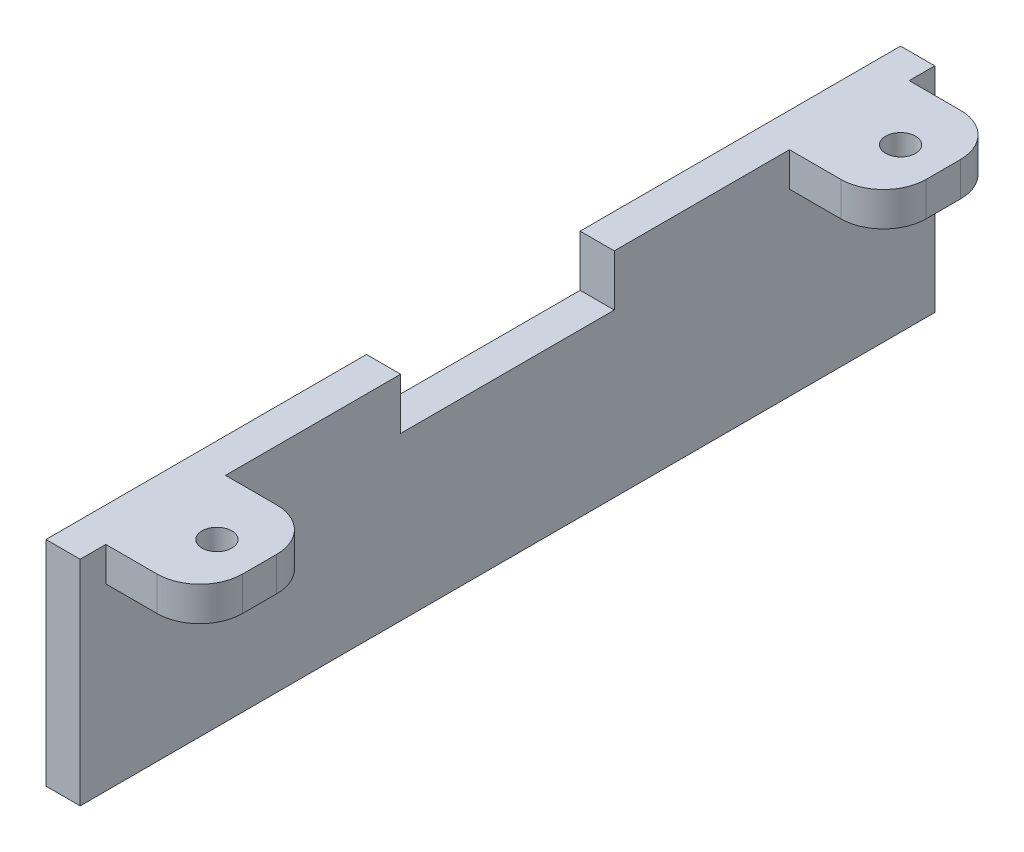
ISO-10303-21;
HEADER;
FILE_DESCRIPTION(('STEP AP214'),'2;1');
FILE_NAME('part.step','',(''),(''),'','','');
FILE_SCHEMA(('AUTOMOTIVE_DESIGN { 1 0 10303 214 1 1 1 1 }'));
ENDSEC;
DATA;
#1=APPLICATION_CONTEXT('core data for automotive mechanical design processes');
#2=APPLICATION_PROTOCOL_DEFINITION('international standard','automotive_design',2000,#1);
#3=PRODUCT_CONTEXT('',#1,'mechanical');
#4=PRODUCT('Part','Part','',(#3));
#5=PRODUCT_RELATED_PRODUCT_CATEGORY('part','',(#4));
#6=PRODUCT_DEFINITION_FORMATION('','',#4);
#7=PRODUCT_DEFINITION_CONTEXT('part definition',#1,'design');
#8=PRODUCT_DEFINITION('design','',#6,#7);
#9=PRODUCT_DEFINITION_SHAPE('','',#8);
#10=(LENGTH_UNIT() NAMED_UNIT(*) SI_UNIT(.MILLI.,.METRE.));
#11=(NAMED_UNIT(*) PLANE_ANGLE_UNIT() SI_UNIT($,.RADIAN.));
#12=(NAMED_UNIT(*) SI_UNIT($,.STERADIAN.) SOLID_ANGLE_UNIT());
#13=UNCERTAINTY_MEASURE_WITH_UNIT(LENGTH_MEASURE(1.E-05),#10,'distance_accuracy_value','');
#14=(GEOMETRIC_REPRESENTATION_CONTEXT(3) GLOBAL_UNCERTAINTY_ASSIGNED_CONTEXT((#13)) GLOBAL_UNIT_ASSIGNED_CONTEXT((#10,
#11,#12)) REPRESENTATION_CONTEXT('',''));
#15=CARTESIAN_POINT('',(0.,0.,0.));
#16=DIRECTION('',(0.,0.,1.));
#17=DIRECTION('',(1.,0.,0.));
#18=AXIS2_PLACEMENT_3D('',#15,#16,#17);
#19=CARTESIAN_POINT('',(15.,0.,100.));
#20=DIRECTION('',(0.,-1.,0.));
#21=DIRECTION('',(1.,0.,0.));
#22=AXIS2_PLACEMENT_3D('',#19,#20,#21);
#23=PLANE('',#22);
#24=CARTESIAN_POINT('',(10.,0.,90.));
#25=DIRECTION('',(0.,1.,0.));
#26=DIRECTION('',(1.,0.,0.));
#27=AXIS2_PLACEMENT_3D('',#24,#25,#26);
#28=CIRCLE('',#27,1.75);
#29=CARTESIAN_POINT('',(11.75,0.,90.));
#30=VERTEX_POINT('',#29);
#31=EDGE_CURVE('E211',#30,#30,#28,.T.);
#32=ORIENTED_EDGE('',*,*,#31,.F.);
#33=EDGE_LOOP('',(#32));
#34=FACE_BOUND('',#33,.T.);
#35=DIRECTION('',(0.,0.,1.));
#36=VECTOR('',#35,1.);
#37=CARTESIAN_POINT('',(4.,0.,17.));
#38=LINE('',#37,#36);
#39=CARTESIAN_POINT('',(4.00000000000001,0.,62.5));
#40=VERTEX_POINT('',#39);
#41=CARTESIAN_POINT('',(4.00000000000001,0.,83.));
#42=VERTEX_POINT('',#41);
#43=EDGE_CURVE('E216',#40,#42,#38,.T.);
#44=ORIENTED_EDGE('',*,*,#43,.F.);
#45=DIRECTION('',(-1.,0.,0.));
#46=VECTOR('',#45,1.);
#47=CARTESIAN_POINT('',(15.,0.,62.5));
#48=LINE('',#47,#46);
#49=CARTESIAN_POINT('',(0.,0.,62.5));
#50=VERTEX_POINT('',#49);
#51=EDGE_CURVE('E195',#40,#50,#48,.T.);
#52=ORIENTED_EDGE('',*,*,#51,.T.);
#53=DIRECTION('',(0.,0.,-1.));
#54=VECTOR('',#53,1.);
#55=CARTESIAN_POINT('',(0.,0.,100.));
#56=LINE('',#55,#54);
#57=CARTESIAN_POINT('',(0.,0.,100.));
#58=VERTEX_POINT('',#57);
#59=EDGE_CURVE('E269',#58,#50,#56,.T.);
#60=ORIENTED_EDGE('',*,*,#59,.F.);
#61=DIRECTION('',(-1.,0.,0.));
#62=VECTOR('',#61,1.);
#63=CARTESIAN_POINT('',(15.,0.,100.));
#64=LINE('',#63,#62);
#65=CARTESIAN_POINT('',(4.,0.,100.));
#66=VERTEX_POINT('',#65);
#67=EDGE_CURVE('E238',#66,#58,#64,.T.);
#68=ORIENTED_EDGE('',*,*,#67,.F.);
#69=DIRECTION('',(0.,0.,1.));
#70=VECTOR('',#69,1.);
#71=CARTESIAN_POINT('',(4.,0.,100.));
#72=LINE('',#71,#70);
#73=CARTESIAN_POINT('',(4.00000000000002,0.,97.));
#74=VERTEX_POINT('',#73);
#75=EDGE_CURVE('E228',#74,#66,#72,.T.);
#76=ORIENTED_EDGE('',*,*,#75,.F.);
#77=DIRECTION('',(-1.,0.,0.));
#78=VECTOR('',#77,1.);
#79=CARTESIAN_POINT('',(4.00000000000002,0.,97.));
#80=LINE('',#79,#78);
#81=CARTESIAN_POINT('',(9.99999999999999,0.,97.));
#82=VERTEX_POINT('',#81);
#83=EDGE_CURVE('E231',#82,#74,#80,.T.);
#84=ORIENTED_EDGE('',*,*,#83,.F.);
#85=CARTESIAN_POINT('',(10.,0.,92.));
#86=DIRECTION('',(0.,-1.,0.));
#87=DIRECTION('',(1.,0.,0.));
#88=AXIS2_PLACEMENT_3D('',#85,#86,#87);
#89=CIRCLE('',#88,5.);
#90=CARTESIAN_POINT('',(15.,0.,92.));
#91=VERTEX_POINT('',#90);
#92=EDGE_CURVE('E298',#82,#91,#89,.F.);
#93=ORIENTED_EDGE('',*,*,#92,.T.);
#94=DIRECTION('',(0.,0.,-1.));
#95=VECTOR('',#94,1.);
#96=CARTESIAN_POINT('',(15.,0.,100.));
#97=LINE('',#96,#95);
#98=CARTESIAN_POINT('',(15.,0.,88.));
#99=VERTEX_POINT('',#98);
#100=EDGE_CURVE('E272',#91,#99,#97,.T.);
#101=ORIENTED_EDGE('',*,*,#100,.T.);
#102=CARTESIAN_POINT('',(10.,0.,88.));
#103=DIRECTION('',(0.,-1.,0.));
#104=DIRECTION('',(1.,0.,0.));
#105=AXIS2_PLACEMENT_3D('',#102,#103,#104);
#106=CIRCLE('',#105,5.);
#107=CARTESIAN_POINT('',(10.,0.,83.));
#108=VERTEX_POINT('',#107);
#109=EDGE_CURVE('E294',#99,#108,#106,.F.);
#110=ORIENTED_EDGE('',*,*,#109,.T.);
#111=DIRECTION('',(1.,0.,0.));
#112=VECTOR('',#111,1.);
#113=CARTESIAN_POINT('',(15.,0.,83.));
#114=LINE('',#113,#112);
#115=EDGE_CURVE('E220',#42,#108,#114,.T.);
#116=ORIENTED_EDGE('',*,*,#115,.F.);
#117=EDGE_LOOP('',(#44,#52,#60,#68,#76,#84,#93,#101,#110,#116));
#118=FACE_BOUND('',#117,.T.);
#119=ADVANCED_FACE('F33',(#34,#118),#23,.F.);
#120=CARTESIAN_POINT('',(15.,-4.,100.));
#121=DIRECTION('',(-1.,0.,0.));
#122=DIRECTION('',(0.,0.,1.));
#123=AXIS2_PLACEMENT_3D('',#120,#121,#122);
#124=PLANE('',#123);
#125=ORIENTED_EDGE('',*,*,#100,.F.);
#126=DIRECTION('',(0.,1.,0.));
#127=VECTOR('',#126,1.);
#128=CARTESIAN_POINT('',(15.,-4.,92.));
#129=LINE('',#128,#127);
#130=CARTESIAN_POINT('',(15.,-4.,92.));
#131=VERTEX_POINT('',#130);
#132=EDGE_CURVE('E303',#91,#131,#129,.F.);
#133=ORIENTED_EDGE('',*,*,#132,.T.);
#134=DIRECTION('',(0.,0.,-1.));
#135=VECTOR('',#134,1.);
#136=CARTESIAN_POINT('',(15.,-4.,100.));
#137=LINE('',#136,#135);
#138=CARTESIAN_POINT('',(15.,-4.,88.));
#139=VERTEX_POINT('',#138);
#140=EDGE_CURVE('E258',#131,#139,#137,.T.);
#141=ORIENTED_EDGE('',*,*,#140,.T.);
#142=DIRECTION('',(0.,1.,0.));
#143=VECTOR('',#142,1.);
#144=CARTESIAN_POINT('',(15.,-4.,88.));
#145=LINE('',#144,#143);
#146=EDGE_CURVE('E300',#139,#99,#145,.T.);
#147=ORIENTED_EDGE('',*,*,#146,.T.);
#148=EDGE_LOOP('',(#125,#133,#141,#147));
#149=FACE_BOUND('',#148,.T.);
#150=ADVANCED_FACE('F373',(#149),#124,.F.);
#151=CARTESIAN_POINT('',(4.00000000000001,-4.,100.));
#152=DIRECTION('',(0.,1.,0.));
#153=DIRECTION('',(-1.,0.,0.));
#154=AXIS2_PLACEMENT_3D('',#151,#152,#153);
#155=PLANE('',#154);
#156=CARTESIAN_POINT('',(10.,-4.,90.));
#157=DIRECTION('',(0.,1.,0.));
#158=DIRECTION('',(-1.,0.,0.));
#159=AXIS2_PLACEMENT_3D('',#156,#157,#158);
#160=CIRCLE('',#159,1.75);
#161=CARTESIAN_POINT('',(8.25000000000001,-4.,90.));
#162=VERTEX_POINT('',#161);
#163=EDGE_CURVE('E208',#162,#162,#160,.T.);
#164=ORIENTED_EDGE('',*,*,#163,.T.);
#165=EDGE_LOOP('',(#164));
#166=FACE_BOUND('',#165,.T.);
#167=ORIENTED_EDGE('',*,*,#140,.F.);
#168=CARTESIAN_POINT('',(10.,-4.,92.));
#169=DIRECTION('',(0.,1.,0.));
#170=DIRECTION('',(-1.,0.,0.));
#171=AXIS2_PLACEMENT_3D('',#168,#169,#170);
#172=CIRCLE('',#171,5.);
#173=CARTESIAN_POINT('',(9.99999999999999,-4.,97.));
#174=VERTEX_POINT('',#173);
#175=EDGE_CURVE('E307',#131,#174,#172,.F.);
#176=ORIENTED_EDGE('',*,*,#175,.T.);
#177=DIRECTION('',(-1.,0.,0.));
#178=VECTOR('',#177,1.);
#179=CARTESIAN_POINT('',(4.00000000000001,-4.,97.));
#180=LINE('',#179,#178);
#181=CARTESIAN_POINT('',(4.00000000000002,-4.,97.));
#182=VERTEX_POINT('',#181);
#183=EDGE_CURVE('E275',#174,#182,#180,.T.);
#184=ORIENTED_EDGE('',*,*,#183,.T.);
#185=DIRECTION('',(0.,0.,-1.));
#186=VECTOR('',#185,1.);
#187=CARTESIAN_POINT('',(4.00000000000001,-4.,100.));
#188=LINE('',#187,#186);
#189=CARTESIAN_POINT('',(4.00000000000001,-4.,83.));
#190=VERTEX_POINT('',#189);
#191=EDGE_CURVE('E259',#182,#190,#188,.T.);
#192=ORIENTED_EDGE('',*,*,#191,.T.);
#193=DIRECTION('',(1.,0.,0.));
#194=VECTOR('',#193,1.);
#195=CARTESIAN_POINT('',(4.00000000000001,-4.,83.));
#196=LINE('',#195,#194);
#197=CARTESIAN_POINT('',(10.,-4.,83.));
#198=VERTEX_POINT('',#197);
#199=EDGE_CURVE('E279',#190,#198,#196,.T.);
#200=ORIENTED_EDGE('',*,*,#199,.T.);
#201=CARTESIAN_POINT('',(10.,-4.,88.));
#202=DIRECTION('',(0.,1.,0.));
#203=DIRECTION('',(-1.,0.,0.));
#204=AXIS2_PLACEMENT_3D('',#201,#202,#203);
#205=CIRCLE('',#204,5.);
#206=EDGE_CURVE('E305',#198,#139,#205,.F.);
#207=ORIENTED_EDGE('',*,*,#206,.T.);
#208=EDGE_LOOP('',(#167,#176,#184,#192,#200,#207));
#209=FACE_BOUND('',#208,.T.);
#210=ADVANCED_FACE('F387',(#166,#209),#155,.F.);
#211=CARTESIAN_POINT('',(15.,-4.,12.));
#212=VERTEX_POINT('',#211);
#213=CARTESIAN_POINT('',(15.,-4.,8.00000000000002));
#214=VERTEX_POINT('',#213);
#215=EDGE_CURVE('E247',#212,#214,#137,.T.);
#216=ORIENTED_EDGE('',*,*,#215,.T.);
#217=DIRECTION('',(0.,1.,0.));
#218=VECTOR('',#217,1.);
#219=CARTESIAN_POINT('',(15.,-4.,8.00000000000002));
#220=LINE('',#219,#218);
#221=CARTESIAN_POINT('',(15.,0.,8.00000000000002));
#222=VERTEX_POINT('',#221);
#223=EDGE_CURVE('E311',#214,#222,#220,.T.);
#224=ORIENTED_EDGE('',*,*,#223,.T.);
#225=CARTESIAN_POINT('',(15.,0.,12.));
#226=VERTEX_POINT('',#225);
#227=EDGE_CURVE('E271',#226,#222,#97,.T.);
#228=ORIENTED_EDGE('',*,*,#227,.F.);
#229=DIRECTION('',(0.,1.,0.));
#230=VECTOR('',#229,1.);
#231=CARTESIAN_POINT('',(15.,-4.,12.));
#232=LINE('',#231,#230);
#233=EDGE_CURVE('E309',#226,#212,#232,.F.);
#234=ORIENTED_EDGE('',*,*,#233,.T.);
#235=EDGE_LOOP('',(#216,#224,#228,#234));
#236=FACE_BOUND('',#235,.T.);
#237=ADVANCED_FACE('F359',(#236),#124,.F.);
#238=CARTESIAN_POINT('',(10.,0.,10.));
#239=DIRECTION('',(0.,1.,0.));
#240=DIRECTION('',(-1.,0.,0.));
#241=AXIS2_PLACEMENT_3D('',#238,#239,#240);
#242=CIRCLE('',#241,1.75);
#243=CARTESIAN_POINT('',(8.25,0.,10.));
#244=VERTEX_POINT('',#243);
#245=EDGE_CURVE('E203',#244,#244,#242,.T.);
#246=ORIENTED_EDGE('',*,*,#245,.F.);
#247=EDGE_LOOP('',(#246));
#248=FACE_BOUND('',#247,.T.);
#249=CARTESIAN_POINT('',(0.,0.,37.5));
#250=VERTEX_POINT('',#249);
#251=CARTESIAN_POINT('',(0.,0.,0.));
#252=VERTEX_POINT('',#251);
#253=EDGE_CURVE('E268',#250,#252,#56,.T.);
#254=ORIENTED_EDGE('',*,*,#253,.F.);
#255=DIRECTION('',(1.,0.,0.));
#256=VECTOR('',#255,1.);
#257=CARTESIAN_POINT('',(15.,0.,37.5));
#258=LINE('',#257,#256);
#259=CARTESIAN_POINT('',(4.00000000000001,0.,37.5));
#260=VERTEX_POINT('',#259);
#261=EDGE_CURVE('E183',#250,#260,#258,.T.);
#262=ORIENTED_EDGE('',*,*,#261,.T.);
#263=CARTESIAN_POINT('',(4.,0.,17.));
#264=VERTEX_POINT('',#263);
#265=EDGE_CURVE('E217',#264,#260,#38,.T.);
#266=ORIENTED_EDGE('',*,*,#265,.F.);
#267=DIRECTION('',(-1.,0.,0.));
#268=VECTOR('',#267,1.);
#269=CARTESIAN_POINT('',(15.,0.,17.));
#270=LINE('',#269,#268);
#271=CARTESIAN_POINT('',(10.,0.,17.));
#272=VERTEX_POINT('',#271);
#273=EDGE_CURVE('E198',#272,#264,#270,.T.);
#274=ORIENTED_EDGE('',*,*,#273,.F.);
#275=CARTESIAN_POINT('',(10.,0.,12.));
#276=DIRECTION('',(0.,-1.,0.));
#277=DIRECTION('',(1.,0.,0.));
#278=AXIS2_PLACEMENT_3D('',#275,#276,#277);
#279=CIRCLE('',#278,5.);
#280=EDGE_CURVE('E292',#272,#226,#279,.F.);
#281=ORIENTED_EDGE('',*,*,#280,.T.);
#282=ORIENTED_EDGE('',*,*,#227,.T.);
#283=CARTESIAN_POINT('',(10.,0.,8.00000000000002));
#284=DIRECTION('',(0.,-1.,0.));
#285=DIRECTION('',(1.,0.,0.));
#286=AXIS2_PLACEMENT_3D('',#283,#284,#285);
#287=CIRCLE('',#286,5.);
#288=CARTESIAN_POINT('',(9.99999999999999,0.,3.00000000000002));
#289=VERTEX_POINT('',#288);
#290=EDGE_CURVE('E296',#222,#289,#287,.F.);
#291=ORIENTED_EDGE('',*,*,#290,.T.);
#292=DIRECTION('',(1.,0.,0.));
#293=VECTOR('',#292,1.);
#294=CARTESIAN_POINT('',(4.00000000000001,0.,3.00000000000003));
#295=LINE('',#294,#293);
#296=CARTESIAN_POINT('',(4.00000000000001,0.,3.00000000000003));
#297=VERTEX_POINT('',#296);
#298=EDGE_CURVE('E202',#297,#289,#295,.T.);
#299=ORIENTED_EDGE('',*,*,#298,.F.);
#300=DIRECTION('',(0.,0.,1.));
#301=VECTOR('',#300,1.);
#302=CARTESIAN_POINT('',(4.,0.,0.));
#303=LINE('',#302,#301);
#304=CARTESIAN_POINT('',(4.,0.,0.));
#305=VERTEX_POINT('',#304);
#306=EDGE_CURVE('E199',#305,#297,#303,.T.);
#307=ORIENTED_EDGE('',*,*,#306,.F.);
#308=DIRECTION('',(-1.,0.,0.));
#309=VECTOR('',#308,1.);
#310=CARTESIAN_POINT('',(15.,0.,0.));
#311=LINE('',#310,#309);
#312=EDGE_CURVE('E237',#305,#252,#311,.T.);
#313=ORIENTED_EDGE('',*,*,#312,.T.);
#314=EDGE_LOOP('',(#254,#262,#266,#274,#281,#282,#291,#299,#307,#313));
#315=FACE_BOUND('',#314,.T.);
#316=ADVANCED_FACE('F330',(#248,#315),#23,.F.);
#317=CARTESIAN_POINT('',(0.,0.,100.));
#318=DIRECTION('',(1.,0.,0.));
#319=DIRECTION('',(0.,1.,0.));
#320=AXIS2_PLACEMENT_3D('',#317,#318,#319);
#321=PLANE('',#320);
#322=ORIENTED_EDGE('',*,*,#59,.T.);
#323=DIRECTION('',(0.,1.,0.));
#324=VECTOR('',#323,1.);
#325=CARTESIAN_POINT('',(0.,5.99999999999998,62.5));
#326=LINE('',#325,#324);
#327=CARTESIAN_POINT('',(0.,-6.00000000000001,62.5));
#328=VERTEX_POINT('',#327);
#329=EDGE_CURVE('E186',#328,#50,#326,.T.);
#330=ORIENTED_EDGE('',*,*,#329,.F.);
#331=DIRECTION('',(0.,0.,1.));
#332=VECTOR('',#331,1.);
#333=CARTESIAN_POINT('',(0.,-6.00000000000001,37.5));
#334=LINE('',#333,#332);
#335=CARTESIAN_POINT('',(0.,-6.00000000000001,37.5));
#336=VERTEX_POINT('',#335);
#337=EDGE_CURVE('E173',#336,#328,#334,.T.);
#338=ORIENTED_EDGE('',*,*,#337,.F.);
#339=DIRECTION('',(0.,-1.,0.));
#340=VECTOR('',#339,1.);
#341=CARTESIAN_POINT('',(0.,5.99999999999998,37.5));
#342=LINE('',#341,#340);
#343=EDGE_CURVE('E180',#250,#336,#342,.T.);
#344=ORIENTED_EDGE('',*,*,#343,.F.);
#345=ORIENTED_EDGE('',*,*,#253,.T.);
#346=DIRECTION('',(0.,-1.,0.));
#347=VECTOR('',#346,1.);
#348=CARTESIAN_POINT('',(0.,0.,0.));
#349=LINE('',#348,#347);
#350=CARTESIAN_POINT('',(0.,-25.,0.));
#351=VERTEX_POINT('',#350);
#352=EDGE_CURVE('E250',#252,#351,#349,.T.);
#353=ORIENTED_EDGE('',*,*,#352,.T.);
#354=DIRECTION('',(0.,0.,-1.));
#355=VECTOR('',#354,1.);
#356=CARTESIAN_POINT('',(0.,-25.,100.));
#357=LINE('',#356,#355);
#358=CARTESIAN_POINT('',(0.,-25.,100.));
#359=VERTEX_POINT('',#358);
#360=EDGE_CURVE('E265',#359,#351,#357,.T.);
#361=ORIENTED_EDGE('',*,*,#360,.F.);
#362=DIRECTION('',(0.,-1.,0.));
#363=VECTOR('',#362,1.);
#364=CARTESIAN_POINT('',(0.,0.,100.));
#365=LINE('',#364,#363);
#366=EDGE_CURVE('E240',#58,#359,#365,.T.);
#367=ORIENTED_EDGE('',*,*,#366,.F.);
#368=EDGE_LOOP('',(#322,#330,#338,#344,#345,#353,#361,#367));
#369=FACE_BOUND('',#368,.T.);
#370=ADVANCED_FACE('F189',(#369),#321,.F.);
#371=CARTESIAN_POINT('',(0.,-25.,100.));
#372=DIRECTION('',(0.,1.,0.));
#373=DIRECTION('',(0.,0.,1.));
#374=AXIS2_PLACEMENT_3D('',#371,#372,#373);
#375=PLANE('',#374);
#376=DIRECTION('',(1.,0.,0.));
#377=VECTOR('',#376,1.);
#378=CARTESIAN_POINT('',(0.,-25.,0.));
#379=LINE('',#378,#377);
#380=CARTESIAN_POINT('',(4.,-25.,0.));
#381=VERTEX_POINT('',#380);
#382=EDGE_CURVE('E252',#351,#381,#379,.T.);
#383=ORIENTED_EDGE('',*,*,#382,.T.);
#384=DIRECTION('',(0.,0.,-1.));
#385=VECTOR('',#384,1.);
#386=CARTESIAN_POINT('',(4.,-25.,100.));
#387=LINE('',#386,#385);
#388=CARTESIAN_POINT('',(4.,-25.,100.));
#389=VERTEX_POINT('',#388);
#390=EDGE_CURVE('E262',#389,#381,#387,.T.);
#391=ORIENTED_EDGE('',*,*,#390,.F.);
#392=DIRECTION('',(1.,0.,0.));
#393=VECTOR('',#392,1.);
#394=CARTESIAN_POINT('',(0.,-25.,100.));
#395=LINE('',#394,#393);
#396=EDGE_CURVE('E243',#359,#389,#395,.T.);
#397=ORIENTED_EDGE('',*,*,#396,.F.);
#398=ORIENTED_EDGE('',*,*,#360,.T.);
#399=EDGE_LOOP('',(#383,#391,#397,#398));
#400=FACE_BOUND('',#399,.T.);
#401=ADVANCED_FACE('F341',(#400),#375,.F.);
#402=CARTESIAN_POINT('',(4.,-25.,100.));
#403=DIRECTION('',(-1.,0.,0.));
#404=DIRECTION('',(0.,-1.,0.));
#405=AXIS2_PLACEMENT_3D('',#402,#403,#404);
#406=PLANE('',#405);
#407=DIRECTION('',(0.,0.,1.));
#408=VECTOR('',#407,1.);
#409=CARTESIAN_POINT('',(4.00000000000001,-6.00000000000001,100.));
#410=LINE('',#409,#408);
#411=CARTESIAN_POINT('',(4.00000000000001,-6.00000000000001,37.5));
#412=VERTEX_POINT('',#411);
#413=CARTESIAN_POINT('',(4.,-6.00000000000001,62.5));
#414=VERTEX_POINT('',#413);
#415=EDGE_CURVE('E41',#412,#414,#410,.T.);
#416=ORIENTED_EDGE('',*,*,#415,.T.);
#417=DIRECTION('',(0.,1.,0.));
#418=VECTOR('',#417,1.);
#419=CARTESIAN_POINT('',(4.,-25.,62.5));
#420=LINE('',#419,#418);
#421=EDGE_CURVE('E11',#414,#40,#420,.T.);
#422=ORIENTED_EDGE('',*,*,#421,.T.);
#423=ORIENTED_EDGE('',*,*,#43,.T.);
#424=DIRECTION('',(0.,1.,0.));
#425=VECTOR('',#424,1.);
#426=CARTESIAN_POINT('',(4.00000000000001,-100.,83.));
#427=LINE('',#426,#425);
#428=EDGE_CURVE('E214',#190,#42,#427,.T.);
#429=ORIENTED_EDGE('',*,*,#428,.F.);
#430=ORIENTED_EDGE('',*,*,#191,.F.);
#431=DIRECTION('',(0.,1.,0.));
#432=VECTOR('',#431,1.);
#433=CARTESIAN_POINT('',(4.00000000000002,-100.,97.));
#434=LINE('',#433,#432);
#435=EDGE_CURVE('E234',#182,#74,#434,.T.);
#436=ORIENTED_EDGE('',*,*,#435,.T.);
#437=ORIENTED_EDGE('',*,*,#75,.T.);
#438=DIRECTION('',(0.,1.,0.));
#439=VECTOR('',#438,1.);
#440=CARTESIAN_POINT('',(4.,-25.,100.));
#441=LINE('',#440,#439);
#442=EDGE_CURVE('E245',#389,#66,#441,.T.);
#443=ORIENTED_EDGE('',*,*,#442,.F.);
#444=ORIENTED_EDGE('',*,*,#390,.T.);
#445=DIRECTION('',(0.,1.,0.));
#446=VECTOR('',#445,1.);
#447=CARTESIAN_POINT('',(4.,-25.,0.));
#448=LINE('',#447,#446);
#449=EDGE_CURVE('E241',#381,#305,#448,.T.);
#450=ORIENTED_EDGE('',*,*,#449,.T.);
#451=ORIENTED_EDGE('',*,*,#306,.T.);
#452=DIRECTION('',(0.,1.,0.));
#453=VECTOR('',#452,1.);
#454=CARTESIAN_POINT('',(4.00000000000001,-100.,3.00000000000003));
#455=LINE('',#454,#453);
#456=CARTESIAN_POINT('',(4.00000000000001,-4.,3.00000000000003));
#457=VERTEX_POINT('',#456);
#458=EDGE_CURVE('E206',#457,#297,#455,.T.);
#459=ORIENTED_EDGE('',*,*,#458,.F.);
#460=CARTESIAN_POINT('',(4.00000000000001,-4.,17.));
#461=VERTEX_POINT('',#460);
#462=EDGE_CURVE('E263',#461,#457,#188,.T.);
#463=ORIENTED_EDGE('',*,*,#462,.F.);
#464=DIRECTION('',(0.,1.,0.));
#465=VECTOR('',#464,1.);
#466=CARTESIAN_POINT('',(4.,-100.,17.));
#467=LINE('',#466,#465);
#468=EDGE_CURVE('E223',#461,#264,#467,.T.);
#469=ORIENTED_EDGE('',*,*,#468,.T.);
#470=ORIENTED_EDGE('',*,*,#265,.T.);
#471=DIRECTION('',(0.,-1.,0.));
#472=VECTOR('',#471,1.);
#473=CARTESIAN_POINT('',(4.,-25.,37.5));
#474=LINE('',#473,#472);
#475=EDGE_CURVE('E324',#260,#412,#474,.T.);
#476=ORIENTED_EDGE('',*,*,#475,.T.);
#477=EDGE_LOOP('',(#416,#422,#423,#429,#430,#436,#437,#443,#444,#450,#451,#459,#463,#469,#470,#476));
#478=FACE_BOUND('',#477,.T.);
#479=ADVANCED_FACE('F326',(#478),#406,.F.);
#480=CARTESIAN_POINT('',(10.,-4.,10.));
#481=DIRECTION('',(0.,1.,0.));
#482=DIRECTION('',(-1.,0.,0.));
#483=AXIS2_PLACEMENT_3D('',#480,#481,#482);
#484=CIRCLE('',#483,1.75);
#485=CARTESIAN_POINT('',(8.25,-4.,10.));
#486=VERTEX_POINT('',#485);
#487=EDGE_CURVE('E232',#486,#486,#484,.T.);
#488=ORIENTED_EDGE('',*,*,#487,.T.);
#489=EDGE_LOOP('',(#488));
#490=FACE_BOUND('',#489,.T.);
#491=DIRECTION('',(1.,0.,0.));
#492=VECTOR('',#491,1.);
#493=CARTESIAN_POINT('',(3.99999999999988,-4.,3.00000000000003));
#494=LINE('',#493,#492);
#495=CARTESIAN_POINT('',(9.99999999999999,-4.,3.00000000000002));
#496=VERTEX_POINT('',#495);
#497=EDGE_CURVE('E282',#457,#496,#494,.T.);
#498=ORIENTED_EDGE('',*,*,#497,.T.);
#499=CARTESIAN_POINT('',(10.,-4.,8.00000000000002));
#500=DIRECTION('',(0.,1.,0.));
#501=DIRECTION('',(-1.,0.,0.));
#502=AXIS2_PLACEMENT_3D('',#499,#500,#501);
#503=CIRCLE('',#502,5.);
#504=EDGE_CURVE('E317',#496,#214,#503,.F.);
#505=ORIENTED_EDGE('',*,*,#504,.T.);
#506=ORIENTED_EDGE('',*,*,#215,.F.);
#507=CARTESIAN_POINT('',(10.,-4.,12.));
#508=DIRECTION('',(0.,1.,0.));
#509=DIRECTION('',(-1.,0.,0.));
#510=AXIS2_PLACEMENT_3D('',#507,#508,#509);
#511=CIRCLE('',#510,5.);
#512=CARTESIAN_POINT('',(10.,-4.,17.));
#513=VERTEX_POINT('',#512);
#514=EDGE_CURVE('E56',#212,#513,#511,.F.);
#515=ORIENTED_EDGE('',*,*,#514,.T.);
#516=DIRECTION('',(-1.,0.,0.));
#517=VECTOR('',#516,1.);
#518=CARTESIAN_POINT('',(4.00000000000001,-4.,17.));
#519=LINE('',#518,#517);
#520=EDGE_CURVE('E277',#513,#461,#519,.T.);
#521=ORIENTED_EDGE('',*,*,#520,.T.);
#522=ORIENTED_EDGE('',*,*,#462,.T.);
#523=EDGE_LOOP('',(#498,#505,#506,#515,#521,#522));
#524=FACE_BOUND('',#523,.T.);
#525=ADVANCED_FACE('F356',(#490,#524),#155,.F.);
#526=CARTESIAN_POINT('',(0.,0.,100.));
#527=DIRECTION('',(0.,0.,1.));
#528=DIRECTION('',(1.,0.,0.));
#529=AXIS2_PLACEMENT_3D('',#526,#527,#528);
#530=PLANE('',#529);
#531=ORIENTED_EDGE('',*,*,#442,.T.);
#532=ORIENTED_EDGE('',*,*,#67,.T.);
#533=ORIENTED_EDGE('',*,*,#366,.T.);
#534=ORIENTED_EDGE('',*,*,#396,.T.);
#535=EDGE_LOOP('',(#531,#532,#533,#534));
#536=FACE_BOUND('',#535,.T.);
#537=ADVANCED_FACE('F398',(#536),#530,.T.);
#538=CARTESIAN_POINT('',(0.,0.,0.));
#539=DIRECTION('',(0.,0.,1.));
#540=DIRECTION('',(1.,0.,0.));
#541=AXIS2_PLACEMENT_3D('',#538,#539,#540);
#542=PLANE('',#541);
#543=ORIENTED_EDGE('',*,*,#312,.F.);
#544=ORIENTED_EDGE('',*,*,#449,.F.);
#545=ORIENTED_EDGE('',*,*,#382,.F.);
#546=ORIENTED_EDGE('',*,*,#352,.F.);
#547=EDGE_LOOP('',(#543,#544,#545,#546));
#548=FACE_BOUND('',#547,.T.);
#549=ADVANCED_FACE('F344',(#548),#542,.F.);
#550=CARTESIAN_POINT('',(4.00000000000002,-100.,97.));
#551=DIRECTION('',(0.,0.,-1.));
#552=DIRECTION('',(-1.,0.,0.));
#553=AXIS2_PLACEMENT_3D('',#550,#551,#552);
#554=PLANE('',#553);
#555=ORIENTED_EDGE('',*,*,#183,.F.);
#556=DIRECTION('',(0.,1.,0.));
#557=VECTOR('',#556,1.);
#558=CARTESIAN_POINT('',(9.99999999999999,-100.,97.));
#559=LINE('',#558,#557);
#560=EDGE_CURVE('E289',#174,#82,#559,.T.);
#561=ORIENTED_EDGE('',*,*,#560,.T.);
#562=ORIENTED_EDGE('',*,*,#83,.T.);
#563=ORIENTED_EDGE('',*,*,#435,.F.);
#564=EDGE_LOOP('',(#555,#561,#562,#563));
#565=FACE_BOUND('',#564,.T.);
#566=ADVANCED_FACE('F392',(#565),#554,.F.);
#567=CARTESIAN_POINT('',(4.00000000000001,-100.,3.00000000000003));
#568=DIRECTION('',(0.,0.,1.));
#569=DIRECTION('',(1.,0.,0.));
#570=AXIS2_PLACEMENT_3D('',#567,#568,#569);
#571=PLANE('',#570);
#572=ORIENTED_EDGE('',*,*,#298,.T.);
#573=DIRECTION('',(0.,1.,0.));
#574=VECTOR('',#573,1.);
#575=CARTESIAN_POINT('',(9.99999999999999,-100.,3.00000000000002));
#576=LINE('',#575,#574);
#577=EDGE_CURVE('E314',#289,#496,#576,.F.);
#578=ORIENTED_EDGE('',*,*,#577,.T.);
#579=ORIENTED_EDGE('',*,*,#497,.F.);
#580=ORIENTED_EDGE('',*,*,#458,.T.);
#581=EDGE_LOOP('',(#572,#578,#579,#580));
#582=FACE_BOUND('',#581,.T.);
#583=ADVANCED_FACE('F351',(#582),#571,.F.);
#584=CARTESIAN_POINT('',(15.,-100.,83.));
#585=DIRECTION('',(0.,0.,1.));
#586=DIRECTION('',(1.,0.,0.));
#587=AXIS2_PLACEMENT_3D('',#584,#585,#586);
#588=PLANE('',#587);
#589=ORIENTED_EDGE('',*,*,#115,.T.);
#590=DIRECTION('',(0.,1.,0.));
#591=VECTOR('',#590,1.);
#592=CARTESIAN_POINT('',(10.,-100.,83.));
#593=LINE('',#592,#591);
#594=EDGE_CURVE('E319',#108,#198,#593,.F.);
#595=ORIENTED_EDGE('',*,*,#594,.T.);
#596=ORIENTED_EDGE('',*,*,#199,.F.);
#597=ORIENTED_EDGE('',*,*,#428,.T.);
#598=EDGE_LOOP('',(#589,#595,#596,#597));
#599=FACE_BOUND('',#598,.T.);
#600=ADVANCED_FACE('F384',(#599),#588,.F.);
#601=CARTESIAN_POINT('',(15.,-100.,17.));
#602=DIRECTION('',(0.,0.,-1.));
#603=DIRECTION('',(-1.,0.,0.));
#604=AXIS2_PLACEMENT_3D('',#601,#602,#603);
#605=PLANE('',#604);
#606=ORIENTED_EDGE('',*,*,#520,.F.);
#607=DIRECTION('',(0.,1.,0.));
#608=VECTOR('',#607,1.);
#609=CARTESIAN_POINT('',(10.,-100.,17.));
#610=LINE('',#609,#608);
#611=EDGE_CURVE('E321',#513,#272,#610,.T.);
#612=ORIENTED_EDGE('',*,*,#611,.T.);
#613=ORIENTED_EDGE('',*,*,#273,.T.);
#614=ORIENTED_EDGE('',*,*,#468,.F.);
#615=EDGE_LOOP('',(#606,#612,#613,#614));
#616=FACE_BOUND('',#615,.T.);
#617=ADVANCED_FACE('F365',(#616),#605,.F.);
#618=CARTESIAN_POINT('',(10.,-100.,90.));
#619=DIRECTION('',(0.,1.,0.));
#620=DIRECTION('',(-1.,0.,0.));
#621=AXIS2_PLACEMENT_3D('',#618,#619,#620);
#622=CYLINDRICAL_SURFACE('',#621,1.75);
#623=ORIENTED_EDGE('',*,*,#31,.T.);
#624=EDGE_LOOP('',(#623));
#625=FACE_BOUND('',#624,.T.);
#626=ORIENTED_EDGE('',*,*,#163,.F.);
#627=EDGE_LOOP('',(#626));
#628=FACE_BOUND('',#627,.T.);
#629=ADVANCED_FACE('F430',(#625,#628),#622,.F.);
#630=CARTESIAN_POINT('',(9.99999999999999,-100.,10.));
#631=DIRECTION('',(0.,1.,0.));
#632=DIRECTION('',(-1.,0.,0.));
#633=AXIS2_PLACEMENT_3D('',#630,#631,#632);
#634=CYLINDRICAL_SURFACE('',#633,1.75);
#635=ORIENTED_EDGE('',*,*,#245,.T.);
#636=EDGE_LOOP('',(#635));
#637=FACE_BOUND('',#636,.T.);
#638=ORIENTED_EDGE('',*,*,#487,.F.);
#639=EDGE_LOOP('',(#638));
#640=FACE_BOUND('',#639,.T.);
#641=ADVANCED_FACE('F426',(#637,#640),#634,.F.);
#642=CARTESIAN_POINT('',(10.,-100.,92.));
#643=DIRECTION('',(0.,1.,0.));
#644=DIRECTION('',(0.,0.,1.));
#645=AXIS2_PLACEMENT_3D('',#642,#643,#644);
#646=CYLINDRICAL_SURFACE('',#645,5.);
#647=ORIENTED_EDGE('',*,*,#175,.F.);
#648=ORIENTED_EDGE('',*,*,#132,.F.);
#649=ORIENTED_EDGE('',*,*,#92,.F.);
#650=ORIENTED_EDGE('',*,*,#560,.F.);
#651=EDGE_LOOP('',(#647,#648,#649,#650));
#652=FACE_BOUND('',#651,.T.);
#653=ADVANCED_FACE('F429',(#652),#646,.T.);
#654=CARTESIAN_POINT('',(10.,-4.,8.00000000000002));
#655=DIRECTION('',(0.,1.,0.));
#656=DIRECTION('',(0.,0.,1.));
#657=AXIS2_PLACEMENT_3D('',#654,#655,#656);
#658=CYLINDRICAL_SURFACE('',#657,5.);
#659=ORIENTED_EDGE('',*,*,#504,.F.);
#660=ORIENTED_EDGE('',*,*,#577,.F.);
#661=ORIENTED_EDGE('',*,*,#290,.F.);
#662=ORIENTED_EDGE('',*,*,#223,.F.);
#663=EDGE_LOOP('',(#659,#660,#661,#662));
#664=FACE_BOUND('',#663,.T.);
#665=ADVANCED_FACE('F354',(#664),#658,.T.);
#666=CARTESIAN_POINT('',(10.,-4.,88.));
#667=DIRECTION('',(0.,1.,0.));
#668=DIRECTION('',(0.,0.,1.));
#669=AXIS2_PLACEMENT_3D('',#666,#667,#668);
#670=CYLINDRICAL_SURFACE('',#669,5.);
#671=ORIENTED_EDGE('',*,*,#206,.F.);
#672=ORIENTED_EDGE('',*,*,#594,.F.);
#673=ORIENTED_EDGE('',*,*,#109,.F.);
#674=ORIENTED_EDGE('',*,*,#146,.F.);
#675=EDGE_LOOP('',(#671,#672,#673,#674));
#676=FACE_BOUND('',#675,.T.);
#677=ADVANCED_FACE('F379',(#676),#670,.T.);
#678=CARTESIAN_POINT('',(10.,-100.,12.));
#679=DIRECTION('',(0.,1.,0.));
#680=DIRECTION('',(0.,0.,1.));
#681=AXIS2_PLACEMENT_3D('',#678,#679,#680);
#682=CYLINDRICAL_SURFACE('',#681,5.);
#683=ORIENTED_EDGE('',*,*,#514,.F.);
#684=ORIENTED_EDGE('',*,*,#233,.F.);
#685=ORIENTED_EDGE('',*,*,#280,.F.);
#686=ORIENTED_EDGE('',*,*,#611,.F.);
#687=EDGE_LOOP('',(#683,#684,#685,#686));
#688=FACE_BOUND('',#687,.T.);
#689=ADVANCED_FACE('F35',(#688),#682,.T.);
#690=CARTESIAN_POINT('',(100.,5.99999999999999,62.5));
#691=DIRECTION('',(0.,0.,1.));
#692=DIRECTION('',(1.,0.,0.));
#693=AXIS2_PLACEMENT_3D('',#690,#691,#692);
#694=PLANE('',#693);
#695=ORIENTED_EDGE('',*,*,#421,.F.);
#696=DIRECTION('',(-1.,0.,0.));
#697=VECTOR('',#696,1.);
#698=CARTESIAN_POINT('',(100.,-5.99999999999999,62.5));
#699=LINE('',#698,#697);
#700=EDGE_CURVE('E177',#414,#328,#699,.T.);
#701=ORIENTED_EDGE('',*,*,#700,.T.);
#702=ORIENTED_EDGE('',*,*,#329,.T.);
#703=ORIENTED_EDGE('',*,*,#51,.F.);
#704=EDGE_LOOP('',(#695,#701,#702,#703));
#705=FACE_BOUND('',#704,.T.);
#706=ADVANCED_FACE('F534',(#705),#694,.F.);
#707=CARTESIAN_POINT('',(100.,-5.99999999999999,37.5));
#708=DIRECTION('',(0.,-1.,0.));
#709=DIRECTION('',(1.,0.,0.));
#710=AXIS2_PLACEMENT_3D('',#707,#708,#709);
#711=PLANE('',#710);
#712=DIRECTION('',(-1.,0.,0.));
#713=VECTOR('',#712,1.);
#714=CARTESIAN_POINT('',(100.,-5.99999999999999,37.5));
#715=LINE('',#714,#713);
#716=EDGE_CURVE('E48',#412,#336,#715,.T.);
#717=ORIENTED_EDGE('',*,*,#716,.T.);
#718=ORIENTED_EDGE('',*,*,#337,.T.);
#719=ORIENTED_EDGE('',*,*,#700,.F.);
#720=ORIENTED_EDGE('',*,*,#415,.F.);
#721=EDGE_LOOP('',(#717,#718,#719,#720));
#722=FACE_BOUND('',#721,.T.);
#723=ADVANCED_FACE('F170',(#722),#711,.F.);
#724=CARTESIAN_POINT('',(100.,6.,37.5));
#725=DIRECTION('',(0.,0.,-1.));
#726=DIRECTION('',(-1.,0.,0.));
#727=AXIS2_PLACEMENT_3D('',#724,#725,#726);
#728=PLANE('',#727);
#729=ORIENTED_EDGE('',*,*,#343,.T.);
#730=ORIENTED_EDGE('',*,*,#716,.F.);
#731=ORIENTED_EDGE('',*,*,#475,.F.);
#732=ORIENTED_EDGE('',*,*,#261,.F.);
#733=EDGE_LOOP('',(#729,#730,#731,#732));
#734=FACE_BOUND('',#733,.T.);
#735=ADVANCED_FACE('F181',(#734),#728,.F.);
#736=CLOSED_SHELL('',(#119,#150,#210,#237,#316,#370,#401,#479,#525,#537,#549,#566,#583,#600,
#617,#629,#641,#653,#665,#677,#689,#706,#723,#735));
#737=MANIFOLD_SOLID_BREP('B2',#736);
#738=ADVANCED_BREP_SHAPE_REPRESENTATION('',(#18,#737),#14);
#739=SHAPE_DEFINITION_REPRESENTATION(#9,#738);
ENDSEC;
END-ISO-10303-21;
